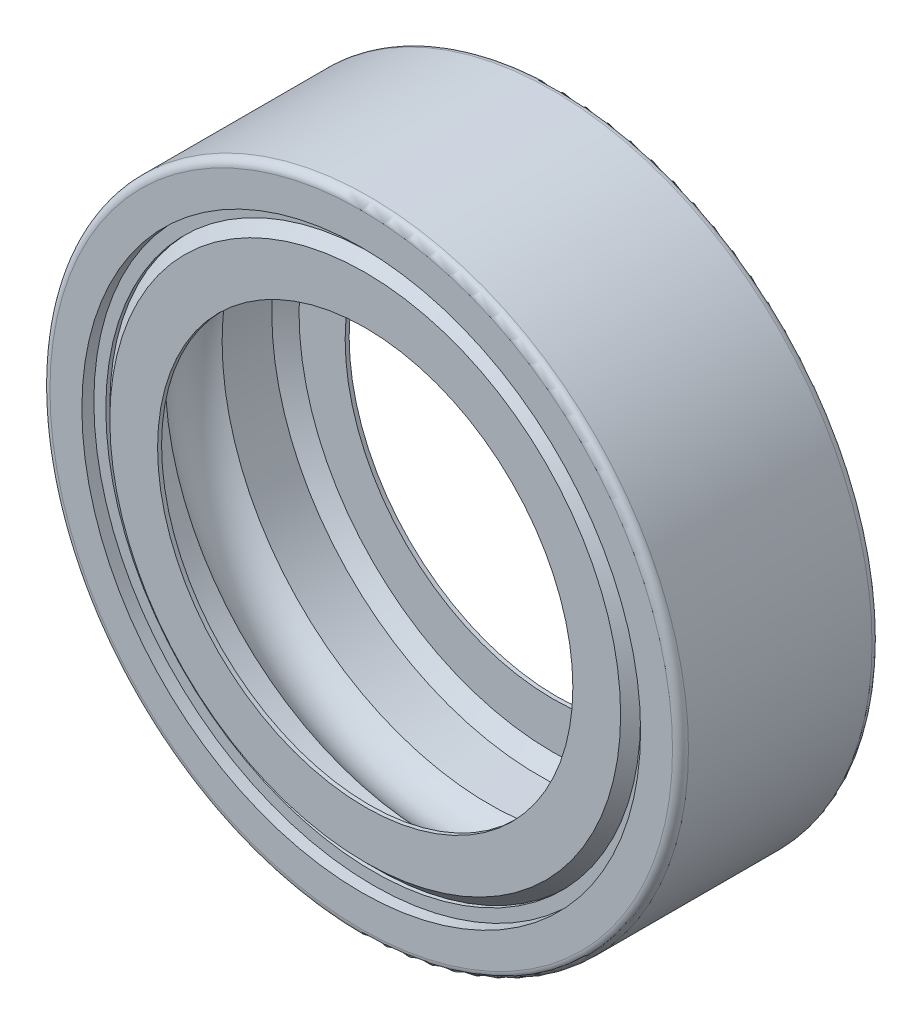
ISO-10303-21;
HEADER;
FILE_DESCRIPTION(('STEP AP214'),'2;1');
FILE_NAME('part.step','',(''),(''),'','','');
FILE_SCHEMA(('AUTOMOTIVE_DESIGN { 1 0 10303 214 1 1 1 1 }'));
ENDSEC;
DATA;
#1=APPLICATION_CONTEXT('core data for automotive mechanical design processes');
#2=APPLICATION_PROTOCOL_DEFINITION('international standard','automotive_design',2000,#1);
#3=PRODUCT_CONTEXT('',#1,'mechanical');
#4=PRODUCT('Part','Part','',(#3));
#5=PRODUCT_RELATED_PRODUCT_CATEGORY('part','',(#4));
#6=PRODUCT_DEFINITION_FORMATION('','',#4);
#7=PRODUCT_DEFINITION_CONTEXT('part definition',#1,'design');
#8=PRODUCT_DEFINITION('design','',#6,#7);
#9=PRODUCT_DEFINITION_SHAPE('','',#8);
#10=(LENGTH_UNIT() NAMED_UNIT(*) SI_UNIT(.MILLI.,.METRE.));
#11=(NAMED_UNIT(*) PLANE_ANGLE_UNIT() SI_UNIT($,.RADIAN.));
#12=(NAMED_UNIT(*) SI_UNIT($,.STERADIAN.) SOLID_ANGLE_UNIT());
#13=UNCERTAINTY_MEASURE_WITH_UNIT(LENGTH_MEASURE(1.E-05),#10,'distance_accuracy_value','');
#14=(GEOMETRIC_REPRESENTATION_CONTEXT(3) GLOBAL_UNCERTAINTY_ASSIGNED_CONTEXT((#13)) GLOBAL_UNIT_ASSIGNED_CONTEXT((#10,
#11,#12)) REPRESENTATION_CONTEXT('',''));
#15=CARTESIAN_POINT('',(0.,0.,0.));
#16=DIRECTION('',(0.,0.,1.));
#17=DIRECTION('',(1.,0.,0.));
#18=AXIS2_PLACEMENT_3D('',#15,#16,#17);
#19=CARTESIAN_POINT('',(0.,0.,2.10000000000001));
#20=DIRECTION('',(0.,0.,-1.));
#21=DIRECTION('',(-1.,0.,0.));
#22=AXIS2_PLACEMENT_3D('',#19,#20,#21);
#23=CONICAL_SURFACE('',#22,6.7,0.785398163397443);
#24=CARTESIAN_POINT('',(0.,0.,2.40000000000001));
#25=DIRECTION('',(0.,0.,1.));
#26=DIRECTION('',(1.,0.,0.));
#27=AXIS2_PLACEMENT_3D('',#24,#25,#26);
#28=CIRCLE('',#27,6.4);
#29=CARTESIAN_POINT('',(6.4,0.,2.40000000000001));
#30=VERTEX_POINT('',#29);
#31=EDGE_CURVE('E108',#30,#30,#28,.T.);
#32=ORIENTED_EDGE('',*,*,#31,.F.);
#33=EDGE_LOOP('',(#32));
#34=FACE_BOUND('',#33,.T.);
#35=CARTESIAN_POINT('',(0.,0.,2.10000000000001));
#36=DIRECTION('',(0.,0.,1.));
#37=DIRECTION('',(1.,0.,0.));
#38=AXIS2_PLACEMENT_3D('',#35,#36,#37);
#39=CIRCLE('',#38,6.7);
#40=CARTESIAN_POINT('',(6.7,0.,2.10000000000001));
#41=VERTEX_POINT('',#40);
#42=EDGE_CURVE('E10',#41,#41,#39,.T.);
#43=ORIENTED_EDGE('',*,*,#42,.T.);
#44=EDGE_LOOP('',(#43));
#45=FACE_BOUND('',#44,.T.);
#46=ADVANCED_FACE('F32',(#34,#45),#23,.T.);
#47=CARTESIAN_POINT('',(0.,0.,6.75539907110854));
#48=DIRECTION('',(0.,0.,1.));
#49=DIRECTION('',(1.,0.,0.));
#50=AXIS2_PLACEMENT_3D('',#47,#48,#49);
#51=CYLINDRICAL_SURFACE('',#50,6.7);
#52=ORIENTED_EDGE('',*,*,#42,.F.);
#53=EDGE_LOOP('',(#52));
#54=FACE_BOUND('',#53,.T.);
#55=CARTESIAN_POINT('',(0.,0.,2.20000000000001));
#56=DIRECTION('',(0.,0.,1.));
#57=DIRECTION('',(1.,0.,0.));
#58=AXIS2_PLACEMENT_3D('',#55,#56,#57);
#59=CIRCLE('',#58,6.7);
#60=CARTESIAN_POINT('',(6.7,0.,2.20000000000001));
#61=VERTEX_POINT('',#60);
#62=EDGE_CURVE('E38',#61,#61,#59,.T.);
#63=ORIENTED_EDGE('',*,*,#62,.T.);
#64=EDGE_LOOP('',(#63));
#65=FACE_BOUND('',#64,.T.);
#66=ADVANCED_FACE('F115',(#54,#65),#51,.F.);
#67=CARTESIAN_POINT('',(0.,7.,2.20000000000001));
#68=DIRECTION('',(0.,0.,-1.));
#69=DIRECTION('',(-1.,0.,0.));
#70=AXIS2_PLACEMENT_3D('',#67,#68,#69);
#71=PLANE('',#70);
#72=ORIENTED_EDGE('',*,*,#62,.F.);
#73=EDGE_LOOP('',(#72));
#74=FACE_BOUND('',#73,.T.);
#75=CARTESIAN_POINT('',(0.,0.,2.20000000000001));
#76=DIRECTION('',(0.,0.,1.));
#77=DIRECTION('',(1.,0.,0.));
#78=AXIS2_PLACEMENT_3D('',#75,#76,#77);
#79=CIRCLE('',#78,7.);
#80=CARTESIAN_POINT('',(7.,0.,2.20000000000001));
#81=VERTEX_POINT('',#80);
#82=EDGE_CURVE('E42',#81,#81,#79,.T.);
#83=ORIENTED_EDGE('',*,*,#82,.T.);
#84=EDGE_LOOP('',(#83));
#85=FACE_BOUND('',#84,.T.);
#86=ADVANCED_FACE('F119',(#74,#85),#71,.F.);
#87=CARTESIAN_POINT('',(0.,0.,6.75539907110854));
#88=DIRECTION('',(0.,0.,1.));
#89=DIRECTION('',(1.,0.,0.));
#90=AXIS2_PLACEMENT_3D('',#87,#88,#89);
#91=CYLINDRICAL_SURFACE('',#90,7.);
#92=ORIENTED_EDGE('',*,*,#82,.F.);
#93=EDGE_LOOP('',(#92));
#94=FACE_BOUND('',#93,.T.);
#95=CARTESIAN_POINT('',(0.,0.,2.50000000000001));
#96=DIRECTION('',(0.,0.,1.));
#97=DIRECTION('',(1.,0.,0.));
#98=AXIS2_PLACEMENT_3D('',#95,#96,#97);
#99=CIRCLE('',#98,7.);
#100=CARTESIAN_POINT('',(7.,0.,2.50000000000001));
#101=VERTEX_POINT('',#100);
#102=EDGE_CURVE('E46',#101,#101,#99,.T.);
#103=ORIENTED_EDGE('',*,*,#102,.T.);
#104=EDGE_LOOP('',(#103));
#105=FACE_BOUND('',#104,.T.);
#106=ADVANCED_FACE('F124',(#94,#105),#91,.F.);
#107=CARTESIAN_POINT('',(0.,7.,2.50000000000001));
#108=DIRECTION('',(0.,0.,-1.));
#109=DIRECTION('',(-1.,0.,0.));
#110=AXIS2_PLACEMENT_3D('',#107,#108,#109);
#111=PLANE('',#110);
#112=ORIENTED_EDGE('',*,*,#102,.F.);
#113=EDGE_LOOP('',(#112));
#114=FACE_BOUND('',#113,.T.);
#115=CARTESIAN_POINT('',(0.,0.,2.50000000000001));
#116=DIRECTION('',(0.,0.,1.));
#117=DIRECTION('',(1.,0.,0.));
#118=AXIS2_PLACEMENT_3D('',#115,#116,#117);
#119=CIRCLE('',#118,7.8);
#120=CARTESIAN_POINT('',(7.8,0.,2.50000000000001));
#121=VERTEX_POINT('',#120);
#122=EDGE_CURVE('E51',#121,#121,#119,.T.);
#123=ORIENTED_EDGE('',*,*,#122,.T.);
#124=EDGE_LOOP('',(#123));
#125=FACE_BOUND('',#124,.T.);
#126=ADVANCED_FACE('F130',(#114,#125),#111,.F.);
#127=CARTESIAN_POINT('',(0.,0.,2.30000000000001));
#128=DIRECTION('',(0.,0.,1.));
#129=DIRECTION('',(1.,0.,0.));
#130=AXIS2_PLACEMENT_3D('',#127,#128,#129);
#131=TOROIDAL_SURFACE('',#130,7.8,0.2);
#132=ORIENTED_EDGE('',*,*,#122,.F.);
#133=EDGE_LOOP('',(#132));
#134=FACE_BOUND('',#133,.T.);
#135=CARTESIAN_POINT('',(0.,0.,2.30000000000001));
#136=DIRECTION('',(0.,0.,1.));
#137=DIRECTION('',(1.,0.,0.));
#138=AXIS2_PLACEMENT_3D('',#135,#136,#137);
#139=CIRCLE('',#138,8.);
#140=CARTESIAN_POINT('',(8.,0.,2.30000000000001));
#141=VERTEX_POINT('',#140);
#142=EDGE_CURVE('E54',#141,#141,#139,.T.);
#143=ORIENTED_EDGE('',*,*,#142,.T.);
#144=EDGE_LOOP('',(#143));
#145=FACE_BOUND('',#144,.T.);
#146=ADVANCED_FACE('F134',(#134,#145),#131,.T.);
#147=CARTESIAN_POINT('',(0.,0.,6.75539907110854));
#148=DIRECTION('',(0.,0.,1.));
#149=DIRECTION('',(1.,0.,0.));
#150=AXIS2_PLACEMENT_3D('',#147,#148,#149);
#151=CYLINDRICAL_SURFACE('',#150,8.);
#152=ORIENTED_EDGE('',*,*,#142,.F.);
#153=EDGE_LOOP('',(#152));
#154=FACE_BOUND('',#153,.T.);
#155=CARTESIAN_POINT('',(0.,0.,-2.30000000000001));
#156=DIRECTION('',(0.,0.,1.));
#157=DIRECTION('',(1.,0.,0.));
#158=AXIS2_PLACEMENT_3D('',#155,#156,#157);
#159=CIRCLE('',#158,8.);
#160=CARTESIAN_POINT('',(8.,0.,-2.30000000000001));
#161=VERTEX_POINT('',#160);
#162=EDGE_CURVE('E57',#161,#161,#159,.T.);
#163=ORIENTED_EDGE('',*,*,#162,.T.);
#164=EDGE_LOOP('',(#163));
#165=FACE_BOUND('',#164,.T.);
#166=ADVANCED_FACE('F138',(#154,#165),#151,.T.);
#167=CARTESIAN_POINT('',(0.,0.,-2.30000000000001));
#168=DIRECTION('',(0.,0.,1.));
#169=DIRECTION('',(1.,0.,0.));
#170=AXIS2_PLACEMENT_3D('',#167,#168,#169);
#171=TOROIDAL_SURFACE('',#170,7.8,0.2);
#172=ORIENTED_EDGE('',*,*,#162,.F.);
#173=EDGE_LOOP('',(#172));
#174=FACE_BOUND('',#173,.T.);
#175=CARTESIAN_POINT('',(0.,0.,-2.50000000000001));
#176=DIRECTION('',(0.,0.,1.));
#177=DIRECTION('',(1.,0.,0.));
#178=AXIS2_PLACEMENT_3D('',#175,#176,#177);
#179=CIRCLE('',#178,7.8);
#180=CARTESIAN_POINT('',(7.8,0.,-2.50000000000001));
#181=VERTEX_POINT('',#180);
#182=EDGE_CURVE('E60',#181,#181,#179,.T.);
#183=ORIENTED_EDGE('',*,*,#182,.T.);
#184=EDGE_LOOP('',(#183));
#185=FACE_BOUND('',#184,.T.);
#186=ADVANCED_FACE('F142',(#174,#185),#171,.T.);
#187=CARTESIAN_POINT('',(0.,7.,-2.50000000000001));
#188=DIRECTION('',(0.,0.,1.));
#189=DIRECTION('',(1.,0.,0.));
#190=AXIS2_PLACEMENT_3D('',#187,#188,#189);
#191=PLANE('',#190);
#192=ORIENTED_EDGE('',*,*,#182,.F.);
#193=EDGE_LOOP('',(#192));
#194=FACE_BOUND('',#193,.T.);
#195=CARTESIAN_POINT('',(0.,0.,-2.50000000000001));
#196=DIRECTION('',(0.,0.,1.));
#197=DIRECTION('',(1.,0.,0.));
#198=AXIS2_PLACEMENT_3D('',#195,#196,#197);
#199=CIRCLE('',#198,7.);
#200=CARTESIAN_POINT('',(7.,0.,-2.50000000000001));
#201=VERTEX_POINT('',#200);
#202=EDGE_CURVE('E63',#201,#201,#199,.T.);
#203=ORIENTED_EDGE('',*,*,#202,.T.);
#204=EDGE_LOOP('',(#203));
#205=FACE_BOUND('',#204,.T.);
#206=ADVANCED_FACE('F146',(#194,#205),#191,.F.);
#207=CARTESIAN_POINT('',(0.,0.,6.75539907110854));
#208=DIRECTION('',(0.,0.,1.));
#209=DIRECTION('',(1.,0.,0.));
#210=AXIS2_PLACEMENT_3D('',#207,#208,#209);
#211=CYLINDRICAL_SURFACE('',#210,7.);
#212=ORIENTED_EDGE('',*,*,#202,.F.);
#213=EDGE_LOOP('',(#212));
#214=FACE_BOUND('',#213,.T.);
#215=CARTESIAN_POINT('',(0.,0.,-2.20000000000001));
#216=DIRECTION('',(0.,0.,1.));
#217=DIRECTION('',(1.,0.,0.));
#218=AXIS2_PLACEMENT_3D('',#215,#216,#217);
#219=CIRCLE('',#218,7.);
#220=CARTESIAN_POINT('',(7.,0.,-2.20000000000001));
#221=VERTEX_POINT('',#220);
#222=EDGE_CURVE('E66',#221,#221,#219,.T.);
#223=ORIENTED_EDGE('',*,*,#222,.T.);
#224=EDGE_LOOP('',(#223));
#225=FACE_BOUND('',#224,.T.);
#226=ADVANCED_FACE('F150',(#214,#225),#211,.F.);
#227=CARTESIAN_POINT('',(0.,7.,-2.20000000000001));
#228=DIRECTION('',(0.,0.,1.));
#229=DIRECTION('',(1.,0.,0.));
#230=AXIS2_PLACEMENT_3D('',#227,#228,#229);
#231=PLANE('',#230);
#232=ORIENTED_EDGE('',*,*,#222,.F.);
#233=EDGE_LOOP('',(#232));
#234=FACE_BOUND('',#233,.T.);
#235=CARTESIAN_POINT('',(0.,0.,-2.20000000000001));
#236=DIRECTION('',(0.,0.,1.));
#237=DIRECTION('',(1.,0.,0.));
#238=AXIS2_PLACEMENT_3D('',#235,#236,#237);
#239=CIRCLE('',#238,6.7);
#240=CARTESIAN_POINT('',(6.7,0.,-2.20000000000001));
#241=VERTEX_POINT('',#240);
#242=EDGE_CURVE('E69',#241,#241,#239,.T.);
#243=ORIENTED_EDGE('',*,*,#242,.T.);
#244=EDGE_LOOP('',(#243));
#245=FACE_BOUND('',#244,.T.);
#246=ADVANCED_FACE('F154',(#234,#245),#231,.F.);
#247=CARTESIAN_POINT('',(0.,0.,6.75539907110854));
#248=DIRECTION('',(0.,0.,1.));
#249=DIRECTION('',(1.,0.,0.));
#250=AXIS2_PLACEMENT_3D('',#247,#248,#249);
#251=CYLINDRICAL_SURFACE('',#250,6.7);
#252=ORIENTED_EDGE('',*,*,#242,.F.);
#253=EDGE_LOOP('',(#252));
#254=FACE_BOUND('',#253,.T.);
#255=CARTESIAN_POINT('',(0.,0.,-2.10000000000001));
#256=DIRECTION('',(0.,0.,1.));
#257=DIRECTION('',(1.,0.,0.));
#258=AXIS2_PLACEMENT_3D('',#255,#256,#257);
#259=CIRCLE('',#258,6.7);
#260=CARTESIAN_POINT('',(6.7,0.,-2.10000000000001));
#261=VERTEX_POINT('',#260);
#262=EDGE_CURVE('E72',#261,#261,#259,.T.);
#263=ORIENTED_EDGE('',*,*,#262,.T.);
#264=EDGE_LOOP('',(#263));
#265=FACE_BOUND('',#264,.T.);
#266=ADVANCED_FACE('F158',(#254,#265),#251,.F.);
#267=CARTESIAN_POINT('',(0.,0.,-2.40000000000001));
#268=DIRECTION('',(0.,0.,1.));
#269=DIRECTION('',(1.,0.,0.));
#270=AXIS2_PLACEMENT_3D('',#267,#268,#269);
#271=CONICAL_SURFACE('',#270,6.4,0.785398163397443);
#272=ORIENTED_EDGE('',*,*,#262,.F.);
#273=EDGE_LOOP('',(#272));
#274=FACE_BOUND('',#273,.T.);
#275=CARTESIAN_POINT('',(0.,0.,-2.40000000000001));
#276=DIRECTION('',(0.,0.,1.));
#277=DIRECTION('',(1.,0.,0.));
#278=AXIS2_PLACEMENT_3D('',#275,#276,#277);
#279=CIRCLE('',#278,6.4);
#280=CARTESIAN_POINT('',(6.4,0.,-2.40000000000001));
#281=VERTEX_POINT('',#280);
#282=EDGE_CURVE('E75',#281,#281,#279,.T.);
#283=ORIENTED_EDGE('',*,*,#282,.T.);
#284=EDGE_LOOP('',(#283));
#285=FACE_BOUND('',#284,.T.);
#286=ADVANCED_FACE('F162',(#274,#285),#271,.T.);
#287=CARTESIAN_POINT('',(0.,6.4,-2.40000000000001));
#288=DIRECTION('',(0.,0.,1.));
#289=DIRECTION('',(1.,0.,0.));
#290=AXIS2_PLACEMENT_3D('',#287,#288,#289);
#291=PLANE('',#290);
#292=ORIENTED_EDGE('',*,*,#282,.F.);
#293=EDGE_LOOP('',(#292));
#294=FACE_BOUND('',#293,.T.);
#295=CARTESIAN_POINT('',(0.,0.,-2.40000000000001));
#296=DIRECTION('',(0.,0.,1.));
#297=DIRECTION('',(1.,0.,0.));
#298=AXIS2_PLACEMENT_3D('',#295,#296,#297);
#299=CIRCLE('',#298,5.20290790050683);
#300=CARTESIAN_POINT('',(5.20290790050683,0.,-2.40000000000001));
#301=VERTEX_POINT('',#300);
#302=EDGE_CURVE('E78',#301,#301,#299,.T.);
#303=ORIENTED_EDGE('',*,*,#302,.T.);
#304=EDGE_LOOP('',(#303));
#305=FACE_BOUND('',#304,.T.);
#306=ADVANCED_FACE('F166',(#294,#305),#291,.F.);
#307=CARTESIAN_POINT('',(0.,0.,6.75539907110854));
#308=DIRECTION('',(0.,0.,1.));
#309=DIRECTION('',(1.,0.,0.));
#310=AXIS2_PLACEMENT_3D('',#307,#308,#309);
#311=CYLINDRICAL_SURFACE('',#310,5.20290790050683);
#312=ORIENTED_EDGE('',*,*,#302,.F.);
#313=EDGE_LOOP('',(#312));
#314=FACE_BOUND('',#313,.T.);
#315=CARTESIAN_POINT('',(0.,0.,-2.30000000000001));
#316=DIRECTION('',(0.,0.,1.));
#317=DIRECTION('',(1.,0.,0.));
#318=AXIS2_PLACEMENT_3D('',#315,#316,#317);
#319=CIRCLE('',#318,5.20290790050683);
#320=CARTESIAN_POINT('',(5.20290790050683,0.,-2.30000000000001));
#321=VERTEX_POINT('',#320);
#322=EDGE_CURVE('E81',#321,#321,#319,.T.);
#323=ORIENTED_EDGE('',*,*,#322,.T.);
#324=EDGE_LOOP('',(#323));
#325=FACE_BOUND('',#324,.T.);
#326=ADVANCED_FACE('F170',(#314,#325),#311,.F.);
#327=CARTESIAN_POINT('',(0.,5.20290790050683,-2.30000000000001));
#328=DIRECTION('',(0.,0.,-1.));
#329=DIRECTION('',(-1.,0.,0.));
#330=AXIS2_PLACEMENT_3D('',#327,#328,#329);
#331=PLANE('',#330);
#332=ORIENTED_EDGE('',*,*,#322,.F.);
#333=EDGE_LOOP('',(#332));
#334=FACE_BOUND('',#333,.T.);
#335=CARTESIAN_POINT('',(0.,0.,-2.30000000000001));
#336=DIRECTION('',(0.,0.,1.));
#337=DIRECTION('',(1.,0.,0.));
#338=AXIS2_PLACEMENT_3D('',#335,#336,#337);
#339=CIRCLE('',#338,6.35857864376269);
#340=CARTESIAN_POINT('',(6.35857864376269,0.,-2.30000000000001));
#341=VERTEX_POINT('',#340);
#342=EDGE_CURVE('E84',#341,#341,#339,.T.);
#343=ORIENTED_EDGE('',*,*,#342,.T.);
#344=EDGE_LOOP('',(#343));
#345=FACE_BOUND('',#344,.T.);
#346=ADVANCED_FACE('F174',(#334,#345),#331,.F.);
#347=CARTESIAN_POINT('',(0.,0.,-1.9585786437627));
#348=DIRECTION('',(0.,0.,1.));
#349=DIRECTION('',(1.,0.,0.));
#350=AXIS2_PLACEMENT_3D('',#347,#348,#349);
#351=CONICAL_SURFACE('',#350,6.7,0.785398163397443);
#352=ORIENTED_EDGE('',*,*,#342,.F.);
#353=EDGE_LOOP('',(#352));
#354=FACE_BOUND('',#353,.T.);
#355=CARTESIAN_POINT('',(0.,0.,-1.9585786437627));
#356=DIRECTION('',(0.,0.,1.));
#357=DIRECTION('',(1.,0.,0.));
#358=AXIS2_PLACEMENT_3D('',#355,#356,#357);
#359=CIRCLE('',#358,6.7);
#360=CARTESIAN_POINT('',(6.7,0.,-1.9585786437627));
#361=VERTEX_POINT('',#360);
#362=EDGE_CURVE('E87',#361,#361,#359,.T.);
#363=ORIENTED_EDGE('',*,*,#362,.T.);
#364=EDGE_LOOP('',(#363));
#365=FACE_BOUND('',#364,.T.);
#366=ADVANCED_FACE('F178',(#354,#365),#351,.F.);
#367=CARTESIAN_POINT('',(0.,0.,6.75539907110854));
#368=DIRECTION('',(0.,0.,1.));
#369=DIRECTION('',(1.,0.,0.));
#370=AXIS2_PLACEMENT_3D('',#367,#368,#369);
#371=CYLINDRICAL_SURFACE('',#370,6.7);
#372=ORIENTED_EDGE('',*,*,#362,.F.);
#373=EDGE_LOOP('',(#372));
#374=FACE_BOUND('',#373,.T.);
#375=CARTESIAN_POINT('',(0.,0.,-0.714142842854286));
#376=DIRECTION('',(0.,0.,1.));
#377=DIRECTION('',(1.,0.,0.));
#378=AXIS2_PLACEMENT_3D('',#375,#376,#377);
#379=CIRCLE('',#378,6.7);
#380=CARTESIAN_POINT('',(6.7,0.,-0.714142842854286));
#381=VERTEX_POINT('',#380);
#382=EDGE_CURVE('E90',#381,#381,#379,.T.);
#383=ORIENTED_EDGE('',*,*,#382,.T.);
#384=EDGE_LOOP('',(#383));
#385=FACE_BOUND('',#384,.T.);
#386=ADVANCED_FACE('F182',(#374,#385),#371,.F.);
#387=CARTESIAN_POINT('',(0.,0.,0.));
#388=DIRECTION('',(0.,0.,1.));
#389=DIRECTION('',(1.,0.,0.));
#390=AXIS2_PLACEMENT_3D('',#387,#388,#389);
#391=TOROIDAL_SURFACE('',#390,6.,1.);
#392=ORIENTED_EDGE('',*,*,#382,.F.);
#393=EDGE_LOOP('',(#392));
#394=FACE_BOUND('',#393,.T.);
#395=CARTESIAN_POINT('',(0.,0.,0.714142842854286));
#396=DIRECTION('',(0.,0.,1.));
#397=DIRECTION('',(1.,0.,0.));
#398=AXIS2_PLACEMENT_3D('',#395,#396,#397);
#399=CIRCLE('',#398,6.7);
#400=CARTESIAN_POINT('',(6.7,0.,0.714142842854286));
#401=VERTEX_POINT('',#400);
#402=EDGE_CURVE('E93',#401,#401,#399,.T.);
#403=ORIENTED_EDGE('',*,*,#402,.T.);
#404=EDGE_LOOP('',(#403));
#405=FACE_BOUND('',#404,.T.);
#406=ADVANCED_FACE('F186',(#394,#405),#391,.F.);
#407=CARTESIAN_POINT('',(0.,0.,6.75539907110854));
#408=DIRECTION('',(0.,0.,1.));
#409=DIRECTION('',(1.,0.,0.));
#410=AXIS2_PLACEMENT_3D('',#407,#408,#409);
#411=CYLINDRICAL_SURFACE('',#410,6.7);
#412=ORIENTED_EDGE('',*,*,#402,.F.);
#413=EDGE_LOOP('',(#412));
#414=FACE_BOUND('',#413,.T.);
#415=CARTESIAN_POINT('',(0.,0.,1.9585786437627));
#416=DIRECTION('',(0.,0.,1.));
#417=DIRECTION('',(1.,0.,0.));
#418=AXIS2_PLACEMENT_3D('',#415,#416,#417);
#419=CIRCLE('',#418,6.7);
#420=CARTESIAN_POINT('',(6.7,0.,1.9585786437627));
#421=VERTEX_POINT('',#420);
#422=EDGE_CURVE('E96',#421,#421,#419,.T.);
#423=ORIENTED_EDGE('',*,*,#422,.T.);
#424=EDGE_LOOP('',(#423));
#425=FACE_BOUND('',#424,.T.);
#426=ADVANCED_FACE('F190',(#414,#425),#411,.F.);
#427=CARTESIAN_POINT('',(0.,0.,2.30000000000001));
#428=DIRECTION('',(0.,0.,-1.));
#429=DIRECTION('',(-1.,0.,0.));
#430=AXIS2_PLACEMENT_3D('',#427,#428,#429);
#431=CONICAL_SURFACE('',#430,6.35857864376269,0.785398163397443);
#432=ORIENTED_EDGE('',*,*,#422,.F.);
#433=EDGE_LOOP('',(#432));
#434=FACE_BOUND('',#433,.T.);
#435=CARTESIAN_POINT('',(0.,0.,2.30000000000001));
#436=DIRECTION('',(0.,0.,1.));
#437=DIRECTION('',(1.,0.,0.));
#438=AXIS2_PLACEMENT_3D('',#435,#436,#437);
#439=CIRCLE('',#438,6.35857864376269);
#440=CARTESIAN_POINT('',(6.35857864376269,0.,2.30000000000001));
#441=VERTEX_POINT('',#440);
#442=EDGE_CURVE('E99',#441,#441,#439,.T.);
#443=ORIENTED_EDGE('',*,*,#442,.T.);
#444=EDGE_LOOP('',(#443));
#445=FACE_BOUND('',#444,.T.);
#446=ADVANCED_FACE('F194',(#434,#445),#431,.F.);
#447=CARTESIAN_POINT('',(0.,5.20290790050683,2.30000000000001));
#448=DIRECTION('',(0.,0.,1.));
#449=DIRECTION('',(1.,0.,0.));
#450=AXIS2_PLACEMENT_3D('',#447,#448,#449);
#451=PLANE('',#450);
#452=ORIENTED_EDGE('',*,*,#442,.F.);
#453=EDGE_LOOP('',(#452));
#454=FACE_BOUND('',#453,.T.);
#455=CARTESIAN_POINT('',(0.,0.,2.30000000000001));
#456=DIRECTION('',(0.,0.,1.));
#457=DIRECTION('',(1.,0.,0.));
#458=AXIS2_PLACEMENT_3D('',#455,#456,#457);
#459=CIRCLE('',#458,5.20290790050683);
#460=CARTESIAN_POINT('',(5.20290790050683,0.,2.30000000000001));
#461=VERTEX_POINT('',#460);
#462=EDGE_CURVE('E102',#461,#461,#459,.T.);
#463=ORIENTED_EDGE('',*,*,#462,.T.);
#464=EDGE_LOOP('',(#463));
#465=FACE_BOUND('',#464,.T.);
#466=ADVANCED_FACE('F198',(#454,#465),#451,.F.);
#467=CARTESIAN_POINT('',(0.,0.,6.75539907110854));
#468=DIRECTION('',(0.,0.,1.));
#469=DIRECTION('',(1.,0.,0.));
#470=AXIS2_PLACEMENT_3D('',#467,#468,#469);
#471=CYLINDRICAL_SURFACE('',#470,5.20290790050684);
#472=ORIENTED_EDGE('',*,*,#462,.F.);
#473=EDGE_LOOP('',(#472));
#474=FACE_BOUND('',#473,.T.);
#475=CARTESIAN_POINT('',(0.,0.,2.40000000000001));
#476=DIRECTION('',(0.,0.,1.));
#477=DIRECTION('',(1.,0.,0.));
#478=AXIS2_PLACEMENT_3D('',#475,#476,#477);
#479=CIRCLE('',#478,5.20290790050684);
#480=CARTESIAN_POINT('',(5.20290790050684,0.,2.40000000000001));
#481=VERTEX_POINT('',#480);
#482=EDGE_CURVE('E105',#481,#481,#479,.T.);
#483=ORIENTED_EDGE('',*,*,#482,.T.);
#484=EDGE_LOOP('',(#483));
#485=FACE_BOUND('',#484,.T.);
#486=ADVANCED_FACE('F202',(#474,#485),#471,.F.);
#487=CARTESIAN_POINT('',(0.,6.4,2.40000000000001));
#488=DIRECTION('',(0.,0.,-1.));
#489=DIRECTION('',(-1.,0.,0.));
#490=AXIS2_PLACEMENT_3D('',#487,#488,#489);
#491=PLANE('',#490);
#492=ORIENTED_EDGE('',*,*,#482,.F.);
#493=EDGE_LOOP('',(#492));
#494=FACE_BOUND('',#493,.T.);
#495=ORIENTED_EDGE('',*,*,#31,.T.);
#496=EDGE_LOOP('',(#495));
#497=FACE_BOUND('',#496,.T.);
#498=ADVANCED_FACE('F112',(#494,#497),#491,.F.);
#499=CLOSED_SHELL('',(#46,#66,#86,#106,#126,#146,#166,#186,#206,#226,#246,#266,#286,#306,#326,
#346,#366,#386,#406,#426,#446,#466,#486,#498));
#500=MANIFOLD_SOLID_BREP('B2',#499);
#501=ADVANCED_BREP_SHAPE_REPRESENTATION('',(#18,#500),#14);
#502=SHAPE_DEFINITION_REPRESENTATION(#9,#501);
ENDSEC;
END-ISO-10303-21;
